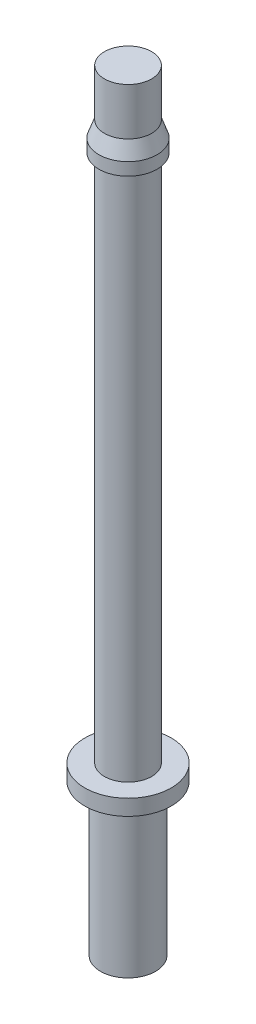
ISO-10303-21;
HEADER;
FILE_DESCRIPTION(('STEP AP214'),'2;1');
FILE_NAME('part.step','',(''),(''),'','','');
FILE_SCHEMA(('AUTOMOTIVE_DESIGN { 1 0 10303 214 1 1 1 1 }'));
ENDSEC;
DATA;
#1=APPLICATION_CONTEXT('core data for automotive mechanical design processes');
#2=APPLICATION_PROTOCOL_DEFINITION('international standard','automotive_design',2000,#1);
#3=PRODUCT_CONTEXT('',#1,'mechanical');
#4=PRODUCT('Part','Part','',(#3));
#5=PRODUCT_RELATED_PRODUCT_CATEGORY('part','',(#4));
#6=PRODUCT_DEFINITION_FORMATION('','',#4);
#7=PRODUCT_DEFINITION_CONTEXT('part definition',#1,'design');
#8=PRODUCT_DEFINITION('design','',#6,#7);
#9=PRODUCT_DEFINITION_SHAPE('','',#8);
#10=(LENGTH_UNIT() NAMED_UNIT(*) SI_UNIT(.MILLI.,.METRE.));
#11=(NAMED_UNIT(*) PLANE_ANGLE_UNIT() SI_UNIT($,.RADIAN.));
#12=(NAMED_UNIT(*) SI_UNIT($,.STERADIAN.) SOLID_ANGLE_UNIT());
#13=UNCERTAINTY_MEASURE_WITH_UNIT(LENGTH_MEASURE(1.E-05),#10,'distance_accuracy_value','');
#14=(GEOMETRIC_REPRESENTATION_CONTEXT(3) GLOBAL_UNCERTAINTY_ASSIGNED_CONTEXT((#13)) GLOBAL_UNIT_ASSIGNED_CONTEXT((#10,
#11,#12)) REPRESENTATION_CONTEXT('',''));
#15=CARTESIAN_POINT('',(0.,0.,0.));
#16=DIRECTION('',(0.,0.,1.));
#17=DIRECTION('',(1.,0.,0.));
#18=AXIS2_PLACEMENT_3D('',#15,#16,#17);
#19=CARTESIAN_POINT('',(0.,0.,0.));
#20=DIRECTION('',(0.,-1.,0.));
#21=DIRECTION('',(0.,0.,-1.));
#22=AXIS2_PLACEMENT_3D('',#19,#20,#21);
#23=PLANE('',#22);
#24=CARTESIAN_POINT('',(0.,0.,0.));
#25=DIRECTION('',(0.,-1.,0.));
#26=DIRECTION('',(0.,0.,-1.));
#27=AXIS2_PLACEMENT_3D('',#24,#25,#26);
#28=CIRCLE('',#27,1.75);
#29=CARTESIAN_POINT('',(0.,0.,-1.75));
#30=VERTEX_POINT('',#29);
#31=EDGE_CURVE('E10',#30,#30,#28,.T.);
#32=ORIENTED_EDGE('',*,*,#31,.T.);
#33=EDGE_LOOP('',(#32));
#34=FACE_BOUND('',#33,.T.);
#35=ADVANCED_FACE('F32',(#34),#23,.T.);
#36=CARTESIAN_POINT('',(0.,0.,0.));
#37=DIRECTION('',(0.,-1.,0.));
#38=DIRECTION('',(0.,0.,-1.));
#39=AXIS2_PLACEMENT_3D('',#36,#37,#38);
#40=CYLINDRICAL_SURFACE('',#39,1.75);
#41=CARTESIAN_POINT('',(0.,9.6,0.));
#42=DIRECTION('',(0.,-1.,0.));
#43=DIRECTION('',(0.,0.,-1.));
#44=AXIS2_PLACEMENT_3D('',#41,#42,#43);
#45=CIRCLE('',#44,1.75);
#46=CARTESIAN_POINT('',(0.,9.6,-1.75));
#47=VERTEX_POINT('',#46);
#48=EDGE_CURVE('E38',#47,#47,#45,.T.);
#49=ORIENTED_EDGE('',*,*,#48,.T.);
#50=EDGE_LOOP('',(#49));
#51=FACE_BOUND('',#50,.T.);
#52=ORIENTED_EDGE('',*,*,#31,.F.);
#53=EDGE_LOOP('',(#52));
#54=FACE_BOUND('',#53,.T.);
#55=ADVANCED_FACE('F82',(#51,#54),#40,.T.);
#56=CARTESIAN_POINT('',(1.75,9.6,0.));
#57=DIRECTION('',(0.,-1.,0.));
#58=DIRECTION('',(0.,0.,-1.));
#59=AXIS2_PLACEMENT_3D('',#56,#57,#58);
#60=PLANE('',#59);
#61=CARTESIAN_POINT('',(0.,9.6,0.));
#62=DIRECTION('',(0.,-1.,0.));
#63=DIRECTION('',(0.,0.,-1.));
#64=AXIS2_PLACEMENT_3D('',#61,#62,#63);
#65=CIRCLE('',#64,2.75);
#66=CARTESIAN_POINT('',(0.,9.6,-2.75));
#67=VERTEX_POINT('',#66);
#68=EDGE_CURVE('E42',#67,#67,#65,.T.);
#69=ORIENTED_EDGE('',*,*,#68,.T.);
#70=EDGE_LOOP('',(#69));
#71=FACE_BOUND('',#70,.T.);
#72=ORIENTED_EDGE('',*,*,#48,.F.);
#73=EDGE_LOOP('',(#72));
#74=FACE_BOUND('',#73,.T.);
#75=ADVANCED_FACE('F86',(#71,#74),#60,.T.);
#76=CARTESIAN_POINT('',(0.,0.,0.));
#77=DIRECTION('',(0.,-1.,0.));
#78=DIRECTION('',(0.,0.,-1.));
#79=AXIS2_PLACEMENT_3D('',#76,#77,#78);
#80=CYLINDRICAL_SURFACE('',#79,2.75);
#81=CARTESIAN_POINT('',(0.,10.6,0.));
#82=DIRECTION('',(0.,-1.,0.));
#83=DIRECTION('',(0.,0.,-1.));
#84=AXIS2_PLACEMENT_3D('',#81,#82,#83);
#85=CIRCLE('',#84,2.75);
#86=CARTESIAN_POINT('',(0.,10.6,-2.75));
#87=VERTEX_POINT('',#86);
#88=EDGE_CURVE('E46',#87,#87,#85,.T.);
#89=ORIENTED_EDGE('',*,*,#88,.T.);
#90=EDGE_LOOP('',(#89));
#91=FACE_BOUND('',#90,.T.);
#92=ORIENTED_EDGE('',*,*,#68,.F.);
#93=EDGE_LOOP('',(#92));
#94=FACE_BOUND('',#93,.T.);
#95=ADVANCED_FACE('F90',(#91,#94),#80,.T.);
#96=CARTESIAN_POINT('',(2.75,10.6,0.));
#97=DIRECTION('',(0.,1.,0.));
#98=DIRECTION('',(0.,0.,1.));
#99=AXIS2_PLACEMENT_3D('',#96,#97,#98);
#100=PLANE('',#99);
#101=CARTESIAN_POINT('',(0.,10.6,0.));
#102=DIRECTION('',(0.,-1.,0.));
#103=DIRECTION('',(0.,0.,-1.));
#104=AXIS2_PLACEMENT_3D('',#101,#102,#103);
#105=CIRCLE('',#104,1.5);
#106=CARTESIAN_POINT('',(0.,10.6,-1.5));
#107=VERTEX_POINT('',#106);
#108=EDGE_CURVE('E51',#107,#107,#105,.T.);
#109=ORIENTED_EDGE('',*,*,#108,.T.);
#110=EDGE_LOOP('',(#109));
#111=FACE_BOUND('',#110,.T.);
#112=ORIENTED_EDGE('',*,*,#88,.F.);
#113=EDGE_LOOP('',(#112));
#114=FACE_BOUND('',#113,.T.);
#115=ADVANCED_FACE('F97',(#111,#114),#100,.T.);
#116=CARTESIAN_POINT('',(0.,0.,0.));
#117=DIRECTION('',(0.,-1.,0.));
#118=DIRECTION('',(0.,0.,-1.));
#119=AXIS2_PLACEMENT_3D('',#116,#117,#118);
#120=CYLINDRICAL_SURFACE('',#119,1.5);
#121=CARTESIAN_POINT('',(0.,44.2,0.));
#122=DIRECTION('',(0.,-1.,0.));
#123=DIRECTION('',(0.,0.,-1.));
#124=AXIS2_PLACEMENT_3D('',#121,#122,#123);
#125=CIRCLE('',#124,1.5);
#126=CARTESIAN_POINT('',(0.,44.2,-1.5));
#127=VERTEX_POINT('',#126);
#128=EDGE_CURVE('E54',#127,#127,#125,.T.);
#129=ORIENTED_EDGE('',*,*,#128,.T.);
#130=EDGE_LOOP('',(#129));
#131=FACE_BOUND('',#130,.T.);
#132=ORIENTED_EDGE('',*,*,#108,.F.);
#133=EDGE_LOOP('',(#132));
#134=FACE_BOUND('',#133,.T.);
#135=ADVANCED_FACE('F101',(#131,#134),#120,.T.);
#136=CARTESIAN_POINT('',(1.5,44.2,0.));
#137=DIRECTION('',(0.,-1.,0.));
#138=DIRECTION('',(0.,0.,-1.));
#139=AXIS2_PLACEMENT_3D('',#136,#137,#138);
#140=PLANE('',#139);
#141=CARTESIAN_POINT('',(0.,44.2,0.));
#142=DIRECTION('',(0.,-1.,0.));
#143=DIRECTION('',(0.,0.,-1.));
#144=AXIS2_PLACEMENT_3D('',#141,#142,#143);
#145=CIRCLE('',#144,1.85);
#146=CARTESIAN_POINT('',(0.,44.2,-1.85));
#147=VERTEX_POINT('',#146);
#148=EDGE_CURVE('E57',#147,#147,#145,.T.);
#149=ORIENTED_EDGE('',*,*,#148,.T.);
#150=EDGE_LOOP('',(#149));
#151=FACE_BOUND('',#150,.T.);
#152=ORIENTED_EDGE('',*,*,#128,.F.);
#153=EDGE_LOOP('',(#152));
#154=FACE_BOUND('',#153,.T.);
#155=ADVANCED_FACE('F105',(#151,#154),#140,.T.);
#156=CARTESIAN_POINT('',(0.,0.,0.));
#157=DIRECTION('',(0.,-1.,0.));
#158=DIRECTION('',(0.,0.,-1.));
#159=AXIS2_PLACEMENT_3D('',#156,#157,#158);
#160=CYLINDRICAL_SURFACE('',#159,1.85);
#161=CARTESIAN_POINT('',(0.,45.,0.));
#162=DIRECTION('',(0.,-1.,0.));
#163=DIRECTION('',(0.,0.,-1.));
#164=AXIS2_PLACEMENT_3D('',#161,#162,#163);
#165=CIRCLE('',#164,1.85);
#166=CARTESIAN_POINT('',(0.,45.,-1.85));
#167=VERTEX_POINT('',#166);
#168=EDGE_CURVE('E60',#167,#167,#165,.T.);
#169=ORIENTED_EDGE('',*,*,#168,.T.);
#170=EDGE_LOOP('',(#169));
#171=FACE_BOUND('',#170,.T.);
#172=ORIENTED_EDGE('',*,*,#148,.F.);
#173=EDGE_LOOP('',(#172));
#174=FACE_BOUND('',#173,.T.);
#175=ADVANCED_FACE('F109',(#171,#174),#160,.T.);
#176=CARTESIAN_POINT('',(0.,45.,0.));
#177=DIRECTION('',(0.,-1.,0.));
#178=DIRECTION('',(0.,0.,-1.));
#179=AXIS2_PLACEMENT_3D('',#176,#177,#178);
#180=CONICAL_SURFACE('',#179,1.85,0.336674819386729);
#181=CARTESIAN_POINT('',(0.,46.,0.));
#182=DIRECTION('',(0.,-1.,0.));
#183=DIRECTION('',(0.,0.,-1.));
#184=AXIS2_PLACEMENT_3D('',#181,#182,#183);
#185=CIRCLE('',#184,1.5);
#186=CARTESIAN_POINT('',(0.,46.,-1.5));
#187=VERTEX_POINT('',#186);
#188=EDGE_CURVE('E63',#187,#187,#185,.T.);
#189=ORIENTED_EDGE('',*,*,#188,.T.);
#190=EDGE_LOOP('',(#189));
#191=FACE_BOUND('',#190,.T.);
#192=ORIENTED_EDGE('',*,*,#168,.F.);
#193=EDGE_LOOP('',(#192));
#194=FACE_BOUND('',#193,.T.);
#195=ADVANCED_FACE('F79',(#191,#194),#180,.T.);
#196=CARTESIAN_POINT('',(0.,0.,0.));
#197=DIRECTION('',(0.,-1.,0.));
#198=DIRECTION('',(0.,0.,-1.));
#199=AXIS2_PLACEMENT_3D('',#196,#197,#198);
#200=CYLINDRICAL_SURFACE('',#199,1.5);
#201=CARTESIAN_POINT('',(0.,49.,0.));
#202=DIRECTION('',(0.,-1.,0.));
#203=DIRECTION('',(0.,0.,-1.));
#204=AXIS2_PLACEMENT_3D('',#201,#202,#203);
#205=CIRCLE('',#204,1.5);
#206=CARTESIAN_POINT('',(0.,49.,-1.5));
#207=VERTEX_POINT('',#206);
#208=EDGE_CURVE('E66',#207,#207,#205,.T.);
#209=ORIENTED_EDGE('',*,*,#208,.T.);
#210=EDGE_LOOP('',(#209));
#211=FACE_BOUND('',#210,.T.);
#212=ORIENTED_EDGE('',*,*,#188,.F.);
#213=EDGE_LOOP('',(#212));
#214=FACE_BOUND('',#213,.T.);
#215=ADVANCED_FACE('F70',(#211,#214),#200,.T.);
#216=CARTESIAN_POINT('',(1.5,49.,0.));
#217=DIRECTION('',(0.,1.,0.));
#218=DIRECTION('',(0.,0.,1.));
#219=AXIS2_PLACEMENT_3D('',#216,#217,#218);
#220=PLANE('',#219);
#221=ORIENTED_EDGE('',*,*,#208,.F.);
#222=EDGE_LOOP('',(#221));
#223=FACE_BOUND('',#222,.T.);
#224=ADVANCED_FACE('F73',(#223),#220,.T.);
#225=CLOSED_SHELL('',(#35,#55,#75,#95,#115,#135,#155,#175,#195,#215,#224));
#226=MANIFOLD_SOLID_BREP('B2',#225);
#227=ADVANCED_BREP_SHAPE_REPRESENTATION('',(#18,#226),#14);
#228=SHAPE_DEFINITION_REPRESENTATION(#9,#227);
ENDSEC;
END-ISO-10303-21;
